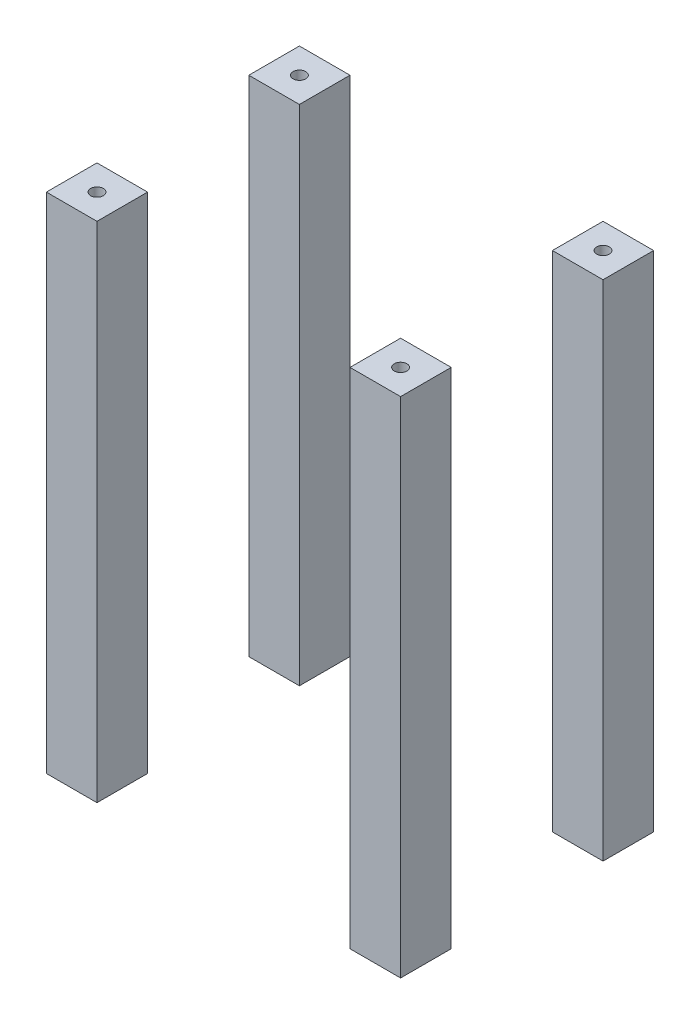
ISO-10303-21;
HEADER;
FILE_DESCRIPTION(('STEP AP214'),'2;1');
FILE_NAME('part.step','',(''),(''),'','','');
FILE_SCHEMA(('AUTOMOTIVE_DESIGN { 1 0 10303 214 1 1 1 1 }'));
ENDSEC;
DATA;
#1=APPLICATION_CONTEXT('core data for automotive mechanical design processes');
#2=APPLICATION_PROTOCOL_DEFINITION('international standard','automotive_design',2000,#1);
#3=PRODUCT_CONTEXT('',#1,'mechanical');
#4=PRODUCT('Part','Part','',(#3));
#5=PRODUCT_RELATED_PRODUCT_CATEGORY('part','',(#4));
#6=PRODUCT_DEFINITION_FORMATION('','',#4);
#7=PRODUCT_DEFINITION_CONTEXT('part definition',#1,'design');
#8=PRODUCT_DEFINITION('design','',#6,#7);
#9=PRODUCT_DEFINITION_SHAPE('','',#8);
#10=(LENGTH_UNIT() NAMED_UNIT(*) SI_UNIT(.MILLI.,.METRE.));
#11=(NAMED_UNIT(*) PLANE_ANGLE_UNIT() SI_UNIT($,.RADIAN.));
#12=(NAMED_UNIT(*) SI_UNIT($,.STERADIAN.) SOLID_ANGLE_UNIT());
#13=UNCERTAINTY_MEASURE_WITH_UNIT(LENGTH_MEASURE(1.E-05),#10,'distance_accuracy_value','');
#14=(GEOMETRIC_REPRESENTATION_CONTEXT(3) GLOBAL_UNCERTAINTY_ASSIGNED_CONTEXT((#13)) GLOBAL_UNIT_ASSIGNED_CONTEXT((#10,
#11,#12)) REPRESENTATION_CONTEXT('',''));
#15=CARTESIAN_POINT('',(0.,0.,0.));
#16=DIRECTION('',(0.,0.,1.));
#17=DIRECTION('',(1.,0.,0.));
#18=AXIS2_PLACEMENT_3D('',#15,#16,#17);
#19=CARTESIAN_POINT('',(0.,199.,0.));
#20=DIRECTION('',(0.,1.,0.));
#21=DIRECTION('',(0.,0.,1.));
#22=AXIS2_PLACEMENT_3D('',#19,#20,#21);
#23=PLANE('',#22);
#24=DIRECTION('',(0.,0.,1.));
#25=VECTOR('',#24,1.);
#26=CARTESIAN_POINT('',(-70.,199.,112.65));
#27=LINE('',#26,#25);
#28=CARTESIAN_POINT('',(-70.,199.,112.65));
#29=VERTEX_POINT('',#28);
#30=CARTESIAN_POINT('',(-70.,199.,132.65));
#31=VERTEX_POINT('',#30);
#32=EDGE_CURVE('E120',#29,#31,#27,.T.);
#33=ORIENTED_EDGE('',*,*,#32,.T.);
#34=DIRECTION('',(1.,0.,0.));
#35=VECTOR('',#34,1.);
#36=CARTESIAN_POINT('',(-70.,199.,132.65));
#37=LINE('',#36,#35);
#38=CARTESIAN_POINT('',(-50.,199.,132.65));
#39=VERTEX_POINT('',#38);
#40=EDGE_CURVE('E89',#31,#39,#37,.T.);
#41=ORIENTED_EDGE('',*,*,#40,.T.);
#42=DIRECTION('',(0.,0.,-1.));
#43=VECTOR('',#42,1.);
#44=CARTESIAN_POINT('',(-50.,199.,112.65));
#45=LINE('',#44,#43);
#46=CARTESIAN_POINT('',(-50.,199.,112.65));
#47=VERTEX_POINT('',#46);
#48=EDGE_CURVE('E128',#39,#47,#45,.T.);
#49=ORIENTED_EDGE('',*,*,#48,.T.);
#50=DIRECTION('',(-1.,0.,0.));
#51=VECTOR('',#50,1.);
#52=CARTESIAN_POINT('',(-70.,199.,112.65));
#53=LINE('',#52,#51);
#54=EDGE_CURVE('E113',#47,#29,#53,.T.);
#55=ORIENTED_EDGE('',*,*,#54,.T.);
#56=EDGE_LOOP('',(#33,#41,#49,#55));
#57=FACE_BOUND('',#56,.T.);
#58=CARTESIAN_POINT('',(-60.,199.,122.65));
#59=DIRECTION('',(0.,1.,0.));
#60=DIRECTION('',(0.,0.,1.));
#61=AXIS2_PLACEMENT_3D('',#58,#59,#60);
#62=CIRCLE('',#61,2.5);
#63=CARTESIAN_POINT('',(-60.,199.,125.15));
#64=VERTEX_POINT('',#63);
#65=EDGE_CURVE('E60',#64,#64,#62,.T.);
#66=ORIENTED_EDGE('',*,*,#65,.F.);
#67=EDGE_LOOP('',(#66));
#68=FACE_BOUND('',#67,.T.);
#69=ADVANCED_FACE('F56',(#57,#68),#23,.T.);
#70=CARTESIAN_POINT('',(0.,0.,0.));
#71=DIRECTION('',(0.,1.,0.));
#72=DIRECTION('',(0.,0.,1.));
#73=AXIS2_PLACEMENT_3D('',#70,#71,#72);
#74=PLANE('',#73);
#75=DIRECTION('',(0.,0.,1.));
#76=VECTOR('',#75,1.);
#77=CARTESIAN_POINT('',(-70.,0.,112.65));
#78=LINE('',#77,#76);
#79=CARTESIAN_POINT('',(-70.,0.,112.65));
#80=VERTEX_POINT('',#79);
#81=CARTESIAN_POINT('',(-70.,0.,132.65));
#82=VERTEX_POINT('',#81);
#83=EDGE_CURVE('E119',#80,#82,#78,.T.);
#84=ORIENTED_EDGE('',*,*,#83,.F.);
#85=DIRECTION('',(-1.,0.,0.));
#86=VECTOR('',#85,1.);
#87=CARTESIAN_POINT('',(-70.,0.,112.65));
#88=LINE('',#87,#86);
#89=CARTESIAN_POINT('',(-50.,0.,112.65));
#90=VERTEX_POINT('',#89);
#91=EDGE_CURVE('E99',#90,#80,#88,.T.);
#92=ORIENTED_EDGE('',*,*,#91,.F.);
#93=DIRECTION('',(0.,0.,-1.));
#94=VECTOR('',#93,1.);
#95=CARTESIAN_POINT('',(-50.,0.,112.65));
#96=LINE('',#95,#94);
#97=CARTESIAN_POINT('',(-50.,0.,132.65));
#98=VERTEX_POINT('',#97);
#99=EDGE_CURVE('E105',#98,#90,#96,.T.);
#100=ORIENTED_EDGE('',*,*,#99,.F.);
#101=DIRECTION('',(1.,0.,0.));
#102=VECTOR('',#101,1.);
#103=CARTESIAN_POINT('',(-70.,0.,132.65));
#104=LINE('',#103,#102);
#105=EDGE_CURVE('E73',#82,#98,#104,.T.);
#106=ORIENTED_EDGE('',*,*,#105,.F.);
#107=EDGE_LOOP('',(#84,#92,#100,#106));
#108=FACE_BOUND('',#107,.T.);
#109=CARTESIAN_POINT('',(-60.,0.,122.65));
#110=DIRECTION('',(0.,1.,0.));
#111=DIRECTION('',(0.,0.,1.));
#112=AXIS2_PLACEMENT_3D('',#109,#110,#111);
#113=CIRCLE('',#112,2.5);
#114=CARTESIAN_POINT('',(-60.,0.,125.15));
#115=VERTEX_POINT('',#114);
#116=EDGE_CURVE('E12',#115,#115,#113,.T.);
#117=ORIENTED_EDGE('',*,*,#116,.T.);
#118=EDGE_LOOP('',(#117));
#119=FACE_BOUND('',#118,.T.);
#120=ADVANCED_FACE('F116',(#108,#119),#74,.F.);
#121=CARTESIAN_POINT('',(-70.,199.,112.65));
#122=DIRECTION('',(1.,0.,0.));
#123=DIRECTION('',(0.,0.,-1.));
#124=AXIS2_PLACEMENT_3D('',#121,#122,#123);
#125=PLANE('',#124);
#126=ORIENTED_EDGE('',*,*,#83,.T.);
#127=DIRECTION('',(0.,-1.,0.));
#128=VECTOR('',#127,1.);
#129=CARTESIAN_POINT('',(-70.,199.,132.65));
#130=LINE('',#129,#128);
#131=EDGE_CURVE('E135',#31,#82,#130,.T.);
#132=ORIENTED_EDGE('',*,*,#131,.F.);
#133=ORIENTED_EDGE('',*,*,#32,.F.);
#134=DIRECTION('',(0.,-1.,0.));
#135=VECTOR('',#134,1.);
#136=CARTESIAN_POINT('',(-70.,199.,112.65));
#137=LINE('',#136,#135);
#138=EDGE_CURVE('E114',#29,#80,#137,.T.);
#139=ORIENTED_EDGE('',*,*,#138,.T.);
#140=EDGE_LOOP('',(#126,#132,#133,#139));
#141=FACE_BOUND('',#140,.T.);
#142=ADVANCED_FACE('F134',(#141),#125,.F.);
#143=CARTESIAN_POINT('',(-70.,199.,132.65));
#144=DIRECTION('',(0.,0.,-1.));
#145=DIRECTION('',(-1.,0.,0.));
#146=AXIS2_PLACEMENT_3D('',#143,#144,#145);
#147=PLANE('',#146);
#148=ORIENTED_EDGE('',*,*,#105,.T.);
#149=DIRECTION('',(0.,-1.,0.));
#150=VECTOR('',#149,1.);
#151=CARTESIAN_POINT('',(-50.,199.,132.65));
#152=LINE('',#151,#150);
#153=EDGE_CURVE('E110',#39,#98,#152,.T.);
#154=ORIENTED_EDGE('',*,*,#153,.F.);
#155=ORIENTED_EDGE('',*,*,#40,.F.);
#156=ORIENTED_EDGE('',*,*,#131,.T.);
#157=EDGE_LOOP('',(#148,#154,#155,#156));
#158=FACE_BOUND('',#157,.T.);
#159=ADVANCED_FACE('F138',(#158),#147,.F.);
#160=CARTESIAN_POINT('',(-50.,199.,112.65));
#161=DIRECTION('',(-1.,0.,0.));
#162=DIRECTION('',(0.,0.,1.));
#163=AXIS2_PLACEMENT_3D('',#160,#161,#162);
#164=PLANE('',#163);
#165=ORIENTED_EDGE('',*,*,#99,.T.);
#166=DIRECTION('',(0.,-1.,0.));
#167=VECTOR('',#166,1.);
#168=CARTESIAN_POINT('',(-50.,199.,112.65));
#169=LINE('',#168,#167);
#170=EDGE_CURVE('E108',#47,#90,#169,.T.);
#171=ORIENTED_EDGE('',*,*,#170,.F.);
#172=ORIENTED_EDGE('',*,*,#48,.F.);
#173=ORIENTED_EDGE('',*,*,#153,.T.);
#174=EDGE_LOOP('',(#165,#171,#172,#173));
#175=FACE_BOUND('',#174,.T.);
#176=ADVANCED_FACE('F106',(#175),#164,.F.);
#177=CARTESIAN_POINT('',(-70.,199.,112.65));
#178=DIRECTION('',(0.,0.,1.));
#179=DIRECTION('',(1.,0.,0.));
#180=AXIS2_PLACEMENT_3D('',#177,#178,#179);
#181=PLANE('',#180);
#182=ORIENTED_EDGE('',*,*,#91,.T.);
#183=ORIENTED_EDGE('',*,*,#138,.F.);
#184=ORIENTED_EDGE('',*,*,#54,.F.);
#185=ORIENTED_EDGE('',*,*,#170,.T.);
#186=EDGE_LOOP('',(#182,#183,#184,#185));
#187=FACE_BOUND('',#186,.T.);
#188=ADVANCED_FACE('F112',(#187),#181,.F.);
#189=CARTESIAN_POINT('',(-60.,199.,122.65));
#190=DIRECTION('',(0.,-1.,0.));
#191=DIRECTION('',(0.,0.,-1.));
#192=AXIS2_PLACEMENT_3D('',#189,#190,#191);
#193=CYLINDRICAL_SURFACE('',#192,2.5);
#194=ORIENTED_EDGE('',*,*,#65,.T.);
#195=EDGE_LOOP('',(#194));
#196=FACE_BOUND('',#195,.T.);
#197=ORIENTED_EDGE('',*,*,#116,.F.);
#198=EDGE_LOOP('',(#197));
#199=FACE_BOUND('',#198,.T.);
#200=ADVANCED_FACE('F58',(#196,#199),#193,.F.);
#201=CLOSED_SHELL('',(#69,#120,#142,#159,#176,#188,#200));
#202=MANIFOLD_SOLID_BREP('B2',#201);
#203=CARTESIAN_POINT('',(0.,199.,0.));
#204=DIRECTION('',(0.,1.,0.));
#205=DIRECTION('',(0.,0.,1.));
#206=AXIS2_PLACEMENT_3D('',#203,#204,#205);
#207=PLANE('',#206);
#208=DIRECTION('',(0.,0.,1.));
#209=VECTOR('',#208,1.);
#210=CARTESIAN_POINT('',(50.,199.,112.65));
#211=LINE('',#210,#209);
#212=CARTESIAN_POINT('',(50.,199.,112.65));
#213=VERTEX_POINT('',#212);
#214=CARTESIAN_POINT('',(50.,199.,132.65));
#215=VERTEX_POINT('',#214);
#216=EDGE_CURVE('E279',#213,#215,#211,.T.);
#217=ORIENTED_EDGE('',*,*,#216,.T.);
#218=DIRECTION('',(1.,0.,0.));
#219=VECTOR('',#218,1.);
#220=CARTESIAN_POINT('',(50.,199.,132.65));
#221=LINE('',#220,#219);
#222=CARTESIAN_POINT('',(70.,199.,132.65));
#223=VERTEX_POINT('',#222);
#224=EDGE_CURVE('E245',#215,#223,#221,.T.);
#225=ORIENTED_EDGE('',*,*,#224,.T.);
#226=DIRECTION('',(0.,0.,-1.));
#227=VECTOR('',#226,1.);
#228=CARTESIAN_POINT('',(70.,199.,112.65));
#229=LINE('',#228,#227);
#230=CARTESIAN_POINT('',(70.,199.,112.65));
#231=VERTEX_POINT('',#230);
#232=EDGE_CURVE('E291',#223,#231,#229,.T.);
#233=ORIENTED_EDGE('',*,*,#232,.T.);
#234=DIRECTION('',(-1.,0.,0.));
#235=VECTOR('',#234,1.);
#236=CARTESIAN_POINT('',(50.,199.,112.65));
#237=LINE('',#236,#235);
#238=EDGE_CURVE('E270',#231,#213,#237,.T.);
#239=ORIENTED_EDGE('',*,*,#238,.T.);
#240=EDGE_LOOP('',(#217,#225,#233,#239));
#241=FACE_BOUND('',#240,.T.);
#242=CARTESIAN_POINT('',(60.,199.,122.65));
#243=DIRECTION('',(0.,1.,0.));
#244=DIRECTION('',(0.,0.,1.));
#245=AXIS2_PLACEMENT_3D('',#242,#243,#244);
#246=CIRCLE('',#245,2.5);
#247=CARTESIAN_POINT('',(60.,199.,125.15));
#248=VERTEX_POINT('',#247);
#249=EDGE_CURVE('E215',#248,#248,#246,.T.);
#250=ORIENTED_EDGE('',*,*,#249,.F.);
#251=EDGE_LOOP('',(#250));
#252=FACE_BOUND('',#251,.T.);
#253=ADVANCED_FACE('F211',(#241,#252),#207,.T.);
#254=CARTESIAN_POINT('',(0.,0.,0.));
#255=DIRECTION('',(0.,1.,0.));
#256=DIRECTION('',(0.,0.,1.));
#257=AXIS2_PLACEMENT_3D('',#254,#255,#256);
#258=PLANE('',#257);
#259=DIRECTION('',(0.,0.,1.));
#260=VECTOR('',#259,1.);
#261=CARTESIAN_POINT('',(50.,0.,112.65));
#262=LINE('',#261,#260);
#263=CARTESIAN_POINT('',(50.,0.,112.65));
#264=VERTEX_POINT('',#263);
#265=CARTESIAN_POINT('',(50.,0.,132.65));
#266=VERTEX_POINT('',#265);
#267=EDGE_CURVE('E277',#264,#266,#262,.T.);
#268=ORIENTED_EDGE('',*,*,#267,.F.);
#269=DIRECTION('',(-1.,0.,0.));
#270=VECTOR('',#269,1.);
#271=CARTESIAN_POINT('',(50.,0.,112.65));
#272=LINE('',#271,#270);
#273=CARTESIAN_POINT('',(70.,0.,112.65));
#274=VERTEX_POINT('',#273);
#275=EDGE_CURVE('E255',#274,#264,#272,.T.);
#276=ORIENTED_EDGE('',*,*,#275,.F.);
#277=DIRECTION('',(0.,0.,-1.));
#278=VECTOR('',#277,1.);
#279=CARTESIAN_POINT('',(70.,0.,112.65));
#280=LINE('',#279,#278);
#281=CARTESIAN_POINT('',(70.,0.,132.65));
#282=VERTEX_POINT('',#281);
#283=EDGE_CURVE('E261',#282,#274,#280,.T.);
#284=ORIENTED_EDGE('',*,*,#283,.F.);
#285=DIRECTION('',(1.,0.,0.));
#286=VECTOR('',#285,1.);
#287=CARTESIAN_POINT('',(50.,0.,132.65));
#288=LINE('',#287,#286);
#289=EDGE_CURVE('E229',#266,#282,#288,.T.);
#290=ORIENTED_EDGE('',*,*,#289,.F.);
#291=EDGE_LOOP('',(#268,#276,#284,#290));
#292=FACE_BOUND('',#291,.T.);
#293=CARTESIAN_POINT('',(60.,0.,122.65));
#294=DIRECTION('',(0.,1.,0.));
#295=DIRECTION('',(0.,0.,1.));
#296=AXIS2_PLACEMENT_3D('',#293,#294,#295);
#297=CIRCLE('',#296,2.5);
#298=CARTESIAN_POINT('',(60.,0.,125.15));
#299=VERTEX_POINT('',#298);
#300=EDGE_CURVE('E54',#299,#299,#297,.T.);
#301=ORIENTED_EDGE('',*,*,#300,.T.);
#302=EDGE_LOOP('',(#301));
#303=FACE_BOUND('',#302,.T.);
#304=ADVANCED_FACE('F274',(#292,#303),#258,.F.);
#305=CARTESIAN_POINT('',(50.,199.,112.65));
#306=DIRECTION('',(1.,0.,0.));
#307=DIRECTION('',(0.,0.,-1.));
#308=AXIS2_PLACEMENT_3D('',#305,#306,#307);
#309=PLANE('',#308);
#310=ORIENTED_EDGE('',*,*,#267,.T.);
#311=DIRECTION('',(0.,-1.,0.));
#312=VECTOR('',#311,1.);
#313=CARTESIAN_POINT('',(50.,199.,132.65));
#314=LINE('',#313,#312);
#315=EDGE_CURVE('E298',#215,#266,#314,.T.);
#316=ORIENTED_EDGE('',*,*,#315,.F.);
#317=ORIENTED_EDGE('',*,*,#216,.F.);
#318=DIRECTION('',(0.,-1.,0.));
#319=VECTOR('',#318,1.);
#320=CARTESIAN_POINT('',(50.,199.,112.65));
#321=LINE('',#320,#319);
#322=EDGE_CURVE('E272',#213,#264,#321,.T.);
#323=ORIENTED_EDGE('',*,*,#322,.T.);
#324=EDGE_LOOP('',(#310,#316,#317,#323));
#325=FACE_BOUND('',#324,.T.);
#326=ADVANCED_FACE('F305',(#325),#309,.F.);
#327=CARTESIAN_POINT('',(50.,199.,132.65));
#328=DIRECTION('',(0.,0.,-1.));
#329=DIRECTION('',(-1.,0.,0.));
#330=AXIS2_PLACEMENT_3D('',#327,#328,#329);
#331=PLANE('',#330);
#332=ORIENTED_EDGE('',*,*,#289,.T.);
#333=DIRECTION('',(0.,-1.,0.));
#334=VECTOR('',#333,1.);
#335=CARTESIAN_POINT('',(70.,199.,132.65));
#336=LINE('',#335,#334);
#337=EDGE_CURVE('E266',#223,#282,#336,.T.);
#338=ORIENTED_EDGE('',*,*,#337,.F.);
#339=ORIENTED_EDGE('',*,*,#224,.F.);
#340=ORIENTED_EDGE('',*,*,#315,.T.);
#341=EDGE_LOOP('',(#332,#338,#339,#340));
#342=FACE_BOUND('',#341,.T.);
#343=ADVANCED_FACE('F302',(#342),#331,.F.);
#344=CARTESIAN_POINT('',(70.,199.,112.65));
#345=DIRECTION('',(-1.,0.,0.));
#346=DIRECTION('',(0.,0.,1.));
#347=AXIS2_PLACEMENT_3D('',#344,#345,#346);
#348=PLANE('',#347);
#349=ORIENTED_EDGE('',*,*,#283,.T.);
#350=DIRECTION('',(0.,-1.,0.));
#351=VECTOR('',#350,1.);
#352=CARTESIAN_POINT('',(70.,199.,112.65));
#353=LINE('',#352,#351);
#354=EDGE_CURVE('E264',#231,#274,#353,.T.);
#355=ORIENTED_EDGE('',*,*,#354,.F.);
#356=ORIENTED_EDGE('',*,*,#232,.F.);
#357=ORIENTED_EDGE('',*,*,#337,.T.);
#358=EDGE_LOOP('',(#349,#355,#356,#357));
#359=FACE_BOUND('',#358,.T.);
#360=ADVANCED_FACE('F262',(#359),#348,.F.);
#361=CARTESIAN_POINT('',(50.,199.,112.65));
#362=DIRECTION('',(0.,0.,1.));
#363=DIRECTION('',(1.,0.,0.));
#364=AXIS2_PLACEMENT_3D('',#361,#362,#363);
#365=PLANE('',#364);
#366=ORIENTED_EDGE('',*,*,#275,.T.);
#367=ORIENTED_EDGE('',*,*,#322,.F.);
#368=ORIENTED_EDGE('',*,*,#238,.F.);
#369=ORIENTED_EDGE('',*,*,#354,.T.);
#370=EDGE_LOOP('',(#366,#367,#368,#369));
#371=FACE_BOUND('',#370,.T.);
#372=ADVANCED_FACE('F269',(#371),#365,.F.);
#373=CARTESIAN_POINT('',(60.,199.,122.65));
#374=DIRECTION('',(0.,-1.,0.));
#375=DIRECTION('',(0.,0.,-1.));
#376=AXIS2_PLACEMENT_3D('',#373,#374,#375);
#377=CYLINDRICAL_SURFACE('',#376,2.5);
#378=ORIENTED_EDGE('',*,*,#249,.T.);
#379=EDGE_LOOP('',(#378));
#380=FACE_BOUND('',#379,.T.);
#381=ORIENTED_EDGE('',*,*,#300,.F.);
#382=EDGE_LOOP('',(#381));
#383=FACE_BOUND('',#382,.T.);
#384=ADVANCED_FACE('F213',(#380,#383),#377,.F.);
#385=CLOSED_SHELL('',(#253,#304,#326,#343,#360,#372,#384));
#386=MANIFOLD_SOLID_BREP('B6',#385);
#387=CARTESIAN_POINT('',(0.,199.,0.));
#388=DIRECTION('',(0.,1.,0.));
#389=DIRECTION('',(0.,0.,1.));
#390=AXIS2_PLACEMENT_3D('',#387,#388,#389);
#391=PLANE('',#390);
#392=DIRECTION('',(0.,0.,1.));
#393=VECTOR('',#392,1.);
#394=CARTESIAN_POINT('',(50.,199.,32.65));
#395=LINE('',#394,#393);
#396=CARTESIAN_POINT('',(50.,199.,32.65));
#397=VERTEX_POINT('',#396);
#398=CARTESIAN_POINT('',(50.,199.,52.65));
#399=VERTEX_POINT('',#398);
#400=EDGE_CURVE('E443',#397,#399,#395,.T.);
#401=ORIENTED_EDGE('',*,*,#400,.T.);
#402=DIRECTION('',(1.,0.,0.));
#403=VECTOR('',#402,1.);
#404=CARTESIAN_POINT('',(50.,199.,52.65));
#405=LINE('',#404,#403);
#406=CARTESIAN_POINT('',(70.,199.,52.65));
#407=VERTEX_POINT('',#406);
#408=EDGE_CURVE('E412',#399,#407,#405,.T.);
#409=ORIENTED_EDGE('',*,*,#408,.T.);
#410=DIRECTION('',(0.,0.,-1.));
#411=VECTOR('',#410,1.);
#412=CARTESIAN_POINT('',(70.,199.,32.65));
#413=LINE('',#412,#411);
#414=CARTESIAN_POINT('',(70.,199.,32.65));
#415=VERTEX_POINT('',#414);
#416=EDGE_CURVE('E451',#407,#415,#413,.T.);
#417=ORIENTED_EDGE('',*,*,#416,.T.);
#418=DIRECTION('',(-1.,0.,0.));
#419=VECTOR('',#418,1.);
#420=CARTESIAN_POINT('',(50.,199.,32.65));
#421=LINE('',#420,#419);
#422=EDGE_CURVE('E436',#415,#397,#421,.T.);
#423=ORIENTED_EDGE('',*,*,#422,.T.);
#424=EDGE_LOOP('',(#401,#409,#417,#423));
#425=FACE_BOUND('',#424,.T.);
#426=CARTESIAN_POINT('',(60.,199.,42.65));
#427=DIRECTION('',(0.,1.,0.));
#428=DIRECTION('',(0.,0.,1.));
#429=AXIS2_PLACEMENT_3D('',#426,#427,#428);
#430=CIRCLE('',#429,2.5);
#431=CARTESIAN_POINT('',(60.,199.,45.15));
#432=VERTEX_POINT('',#431);
#433=EDGE_CURVE('E383',#432,#432,#430,.T.);
#434=ORIENTED_EDGE('',*,*,#433,.F.);
#435=EDGE_LOOP('',(#434));
#436=FACE_BOUND('',#435,.T.);
#437=ADVANCED_FACE('F379',(#425,#436),#391,.T.);
#438=CARTESIAN_POINT('',(0.,0.,0.));
#439=DIRECTION('',(0.,1.,0.));
#440=DIRECTION('',(0.,0.,1.));
#441=AXIS2_PLACEMENT_3D('',#438,#439,#440);
#442=PLANE('',#441);
#443=DIRECTION('',(0.,0.,1.));
#444=VECTOR('',#443,1.);
#445=CARTESIAN_POINT('',(50.,0.,32.65));
#446=LINE('',#445,#444);
#447=CARTESIAN_POINT('',(50.,0.,32.65));
#448=VERTEX_POINT('',#447);
#449=CARTESIAN_POINT('',(50.,0.,52.65));
#450=VERTEX_POINT('',#449);
#451=EDGE_CURVE('E442',#448,#450,#446,.T.);
#452=ORIENTED_EDGE('',*,*,#451,.F.);
#453=DIRECTION('',(-1.,0.,0.));
#454=VECTOR('',#453,1.);
#455=CARTESIAN_POINT('',(50.,0.,32.65));
#456=LINE('',#455,#454);
#457=CARTESIAN_POINT('',(70.,0.,32.65));
#458=VERTEX_POINT('',#457);
#459=EDGE_CURVE('E422',#458,#448,#456,.T.);
#460=ORIENTED_EDGE('',*,*,#459,.F.);
#461=DIRECTION('',(0.,0.,-1.));
#462=VECTOR('',#461,1.);
#463=CARTESIAN_POINT('',(70.,0.,32.65));
#464=LINE('',#463,#462);
#465=CARTESIAN_POINT('',(70.,0.,52.65));
#466=VERTEX_POINT('',#465);
#467=EDGE_CURVE('E428',#466,#458,#464,.T.);
#468=ORIENTED_EDGE('',*,*,#467,.F.);
#469=DIRECTION('',(1.,0.,0.));
#470=VECTOR('',#469,1.);
#471=CARTESIAN_POINT('',(50.,0.,52.65));
#472=LINE('',#471,#470);
#473=EDGE_CURVE('E396',#450,#466,#472,.T.);
#474=ORIENTED_EDGE('',*,*,#473,.F.);
#475=EDGE_LOOP('',(#452,#460,#468,#474));
#476=FACE_BOUND('',#475,.T.);
#477=CARTESIAN_POINT('',(60.,0.,42.65));
#478=DIRECTION('',(0.,1.,0.));
#479=DIRECTION('',(0.,0.,1.));
#480=AXIS2_PLACEMENT_3D('',#477,#478,#479);
#481=CIRCLE('',#480,2.5);
#482=CARTESIAN_POINT('',(60.,0.,45.15));
#483=VERTEX_POINT('',#482);
#484=EDGE_CURVE('E209',#483,#483,#481,.T.);
#485=ORIENTED_EDGE('',*,*,#484,.T.);
#486=EDGE_LOOP('',(#485));
#487=FACE_BOUND('',#486,.T.);
#488=ADVANCED_FACE('F439',(#476,#487),#442,.F.);
#489=CARTESIAN_POINT('',(50.,199.,32.65));
#490=DIRECTION('',(1.,0.,0.));
#491=DIRECTION('',(0.,0.,-1.));
#492=AXIS2_PLACEMENT_3D('',#489,#490,#491);
#493=PLANE('',#492);
#494=ORIENTED_EDGE('',*,*,#451,.T.);
#495=DIRECTION('',(0.,-1.,0.));
#496=VECTOR('',#495,1.);
#497=CARTESIAN_POINT('',(50.,199.,52.65));
#498=LINE('',#497,#496);
#499=EDGE_CURVE('E458',#399,#450,#498,.T.);
#500=ORIENTED_EDGE('',*,*,#499,.F.);
#501=ORIENTED_EDGE('',*,*,#400,.F.);
#502=DIRECTION('',(0.,-1.,0.));
#503=VECTOR('',#502,1.);
#504=CARTESIAN_POINT('',(50.,199.,32.65));
#505=LINE('',#504,#503);
#506=EDGE_CURVE('E437',#397,#448,#505,.T.);
#507=ORIENTED_EDGE('',*,*,#506,.T.);
#508=EDGE_LOOP('',(#494,#500,#501,#507));
#509=FACE_BOUND('',#508,.T.);
#510=ADVANCED_FACE('F457',(#509),#493,.F.);
#511=CARTESIAN_POINT('',(50.,199.,52.65));
#512=DIRECTION('',(0.,0.,-1.));
#513=DIRECTION('',(-1.,0.,0.));
#514=AXIS2_PLACEMENT_3D('',#511,#512,#513);
#515=PLANE('',#514);
#516=ORIENTED_EDGE('',*,*,#473,.T.);
#517=DIRECTION('',(0.,-1.,0.));
#518=VECTOR('',#517,1.);
#519=CARTESIAN_POINT('',(70.,199.,52.65));
#520=LINE('',#519,#518);
#521=EDGE_CURVE('E433',#407,#466,#520,.T.);
#522=ORIENTED_EDGE('',*,*,#521,.F.);
#523=ORIENTED_EDGE('',*,*,#408,.F.);
#524=ORIENTED_EDGE('',*,*,#499,.T.);
#525=EDGE_LOOP('',(#516,#522,#523,#524));
#526=FACE_BOUND('',#525,.T.);
#527=ADVANCED_FACE('F461',(#526),#515,.F.);
#528=CARTESIAN_POINT('',(70.,199.,32.65));
#529=DIRECTION('',(-1.,0.,0.));
#530=DIRECTION('',(0.,0.,1.));
#531=AXIS2_PLACEMENT_3D('',#528,#529,#530);
#532=PLANE('',#531);
#533=ORIENTED_EDGE('',*,*,#467,.T.);
#534=DIRECTION('',(0.,-1.,0.));
#535=VECTOR('',#534,1.);
#536=CARTESIAN_POINT('',(70.,199.,32.65));
#537=LINE('',#536,#535);
#538=EDGE_CURVE('E431',#415,#458,#537,.T.);
#539=ORIENTED_EDGE('',*,*,#538,.F.);
#540=ORIENTED_EDGE('',*,*,#416,.F.);
#541=ORIENTED_EDGE('',*,*,#521,.T.);
#542=EDGE_LOOP('',(#533,#539,#540,#541));
#543=FACE_BOUND('',#542,.T.);
#544=ADVANCED_FACE('F429',(#543),#532,.F.);
#545=CARTESIAN_POINT('',(50.,199.,32.65));
#546=DIRECTION('',(0.,0.,1.));
#547=DIRECTION('',(1.,0.,0.));
#548=AXIS2_PLACEMENT_3D('',#545,#546,#547);
#549=PLANE('',#548);
#550=ORIENTED_EDGE('',*,*,#459,.T.);
#551=ORIENTED_EDGE('',*,*,#506,.F.);
#552=ORIENTED_EDGE('',*,*,#422,.F.);
#553=ORIENTED_EDGE('',*,*,#538,.T.);
#554=EDGE_LOOP('',(#550,#551,#552,#553));
#555=FACE_BOUND('',#554,.T.);
#556=ADVANCED_FACE('F435',(#555),#549,.F.);
#557=CARTESIAN_POINT('',(60.,199.,42.65));
#558=DIRECTION('',(0.,-1.,0.));
#559=DIRECTION('',(0.,0.,-1.));
#560=AXIS2_PLACEMENT_3D('',#557,#558,#559);
#561=CYLINDRICAL_SURFACE('',#560,2.5);
#562=ORIENTED_EDGE('',*,*,#433,.T.);
#563=EDGE_LOOP('',(#562));
#564=FACE_BOUND('',#563,.T.);
#565=ORIENTED_EDGE('',*,*,#484,.F.);
#566=EDGE_LOOP('',(#565));
#567=FACE_BOUND('',#566,.T.);
#568=ADVANCED_FACE('F381',(#564,#567),#561,.F.);
#569=CLOSED_SHELL('',(#437,#488,#510,#527,#544,#556,#568));
#570=MANIFOLD_SOLID_BREP('B48',#569);
#571=CARTESIAN_POINT('',(0.,199.,0.));
#572=DIRECTION('',(0.,1.,0.));
#573=DIRECTION('',(0.,0.,1.));
#574=AXIS2_PLACEMENT_3D('',#571,#572,#573);
#575=PLANE('',#574);
#576=DIRECTION('',(0.,0.,1.));
#577=VECTOR('',#576,1.);
#578=CARTESIAN_POINT('',(-70.,199.,32.65));
#579=LINE('',#578,#577);
#580=CARTESIAN_POINT('',(-70.,199.,32.65));
#581=VERTEX_POINT('',#580);
#582=CARTESIAN_POINT('',(-70.,199.,52.65));
#583=VERTEX_POINT('',#582);
#584=EDGE_CURVE('E576',#581,#583,#579,.T.);
#585=ORIENTED_EDGE('',*,*,#584,.T.);
#586=DIRECTION('',(1.,0.,0.));
#587=VECTOR('',#586,1.);
#588=CARTESIAN_POINT('',(-70.,199.,52.65));
#589=LINE('',#588,#587);
#590=CARTESIAN_POINT('',(-50.,199.,52.65));
#591=VERTEX_POINT('',#590);
#592=EDGE_CURVE('E571',#583,#591,#589,.T.);
#593=ORIENTED_EDGE('',*,*,#592,.T.);
#594=DIRECTION('',(0.,0.,-1.));
#595=VECTOR('',#594,1.);
#596=CARTESIAN_POINT('',(-50.,199.,32.65));
#597=LINE('',#596,#595);
#598=CARTESIAN_POINT('',(-50.,199.,32.65));
#599=VERTEX_POINT('',#598);
#600=EDGE_CURVE('E574',#591,#599,#597,.T.);
#601=ORIENTED_EDGE('',*,*,#600,.T.);
#602=DIRECTION('',(-1.,0.,0.));
#603=VECTOR('',#602,1.);
#604=CARTESIAN_POINT('',(-70.,199.,32.65));
#605=LINE('',#604,#603);
#606=EDGE_CURVE('E541',#599,#581,#605,.T.);
#607=ORIENTED_EDGE('',*,*,#606,.T.);
#608=EDGE_LOOP('',(#585,#593,#601,#607));
#609=FACE_BOUND('',#608,.T.);
#610=CARTESIAN_POINT('',(-60.,199.,42.65));
#611=DIRECTION('',(0.,1.,0.));
#612=DIRECTION('',(0.,0.,1.));
#613=AXIS2_PLACEMENT_3D('',#610,#611,#612);
#614=CIRCLE('',#613,2.5);
#615=CARTESIAN_POINT('',(-60.,199.,45.15));
#616=VERTEX_POINT('',#615);
#617=EDGE_CURVE('E591',#616,#616,#614,.T.);
#618=ORIENTED_EDGE('',*,*,#617,.F.);
#619=EDGE_LOOP('',(#618));
#620=FACE_BOUND('',#619,.T.);
#621=ADVANCED_FACE('F524',(#609,#620),#575,.T.);
#622=CARTESIAN_POINT('',(0.,0.,0.));
#623=DIRECTION('',(0.,1.,0.));
#624=DIRECTION('',(0.,0.,1.));
#625=AXIS2_PLACEMENT_3D('',#622,#623,#624);
#626=PLANE('',#625);
#627=DIRECTION('',(0.,0.,1.));
#628=VECTOR('',#627,1.);
#629=CARTESIAN_POINT('',(-70.,0.,32.65));
#630=LINE('',#629,#628);
#631=CARTESIAN_POINT('',(-70.,0.,32.65));
#632=VERTEX_POINT('',#631);
#633=CARTESIAN_POINT('',(-70.,0.,52.65));
#634=VERTEX_POINT('',#633);
#635=EDGE_CURVE('E588',#632,#634,#630,.T.);
#636=ORIENTED_EDGE('',*,*,#635,.F.);
#637=DIRECTION('',(-1.,0.,0.));
#638=VECTOR('',#637,1.);
#639=CARTESIAN_POINT('',(-70.,0.,32.65));
#640=LINE('',#639,#638);
#641=CARTESIAN_POINT('',(-50.,0.,32.65));
#642=VERTEX_POINT('',#641);
#643=EDGE_CURVE('E564',#642,#632,#640,.T.);
#644=ORIENTED_EDGE('',*,*,#643,.F.);
#645=DIRECTION('',(0.,0.,-1.));
#646=VECTOR('',#645,1.);
#647=CARTESIAN_POINT('',(-50.,0.,32.65));
#648=LINE('',#647,#646);
#649=CARTESIAN_POINT('',(-50.,0.,52.65));
#650=VERTEX_POINT('',#649);
#651=EDGE_CURVE('E558',#650,#642,#648,.T.);
#652=ORIENTED_EDGE('',*,*,#651,.F.);
#653=DIRECTION('',(1.,0.,0.));
#654=VECTOR('',#653,1.);
#655=CARTESIAN_POINT('',(-70.,0.,52.65));
#656=LINE('',#655,#654);
#657=EDGE_CURVE('E580',#634,#650,#656,.T.);
#658=ORIENTED_EDGE('',*,*,#657,.F.);
#659=EDGE_LOOP('',(#636,#644,#652,#658));
#660=FACE_BOUND('',#659,.T.);
#661=CARTESIAN_POINT('',(-60.,0.,42.65));
#662=DIRECTION('',(0.,1.,0.));
#663=DIRECTION('',(0.,0.,1.));
#664=AXIS2_PLACEMENT_3D('',#661,#662,#663);
#665=CIRCLE('',#664,2.5);
#666=CARTESIAN_POINT('',(-60.,0.,45.15));
#667=VERTEX_POINT('',#666);
#668=EDGE_CURVE('E603',#667,#667,#665,.T.);
#669=ORIENTED_EDGE('',*,*,#668,.T.);
#670=EDGE_LOOP('',(#669));
#671=FACE_BOUND('',#670,.T.);
#672=ADVANCED_FACE('F599',(#660,#671),#626,.F.);
#673=CARTESIAN_POINT('',(-70.,199.,32.65));
#674=DIRECTION('',(1.,0.,0.));
#675=DIRECTION('',(0.,0.,-1.));
#676=AXIS2_PLACEMENT_3D('',#673,#674,#675);
#677=PLANE('',#676);
#678=ORIENTED_EDGE('',*,*,#635,.T.);
#679=DIRECTION('',(0.,-1.,0.));
#680=VECTOR('',#679,1.);
#681=CARTESIAN_POINT('',(-70.,199.,52.65));
#682=LINE('',#681,#680);
#683=EDGE_CURVE('E377',#583,#634,#682,.T.);
#684=ORIENTED_EDGE('',*,*,#683,.F.);
#685=ORIENTED_EDGE('',*,*,#584,.F.);
#686=DIRECTION('',(0.,-1.,0.));
#687=VECTOR('',#686,1.);
#688=CARTESIAN_POINT('',(-70.,199.,32.65));
#689=LINE('',#688,#687);
#690=EDGE_CURVE('E584',#581,#632,#689,.T.);
#691=ORIENTED_EDGE('',*,*,#690,.T.);
#692=EDGE_LOOP('',(#678,#684,#685,#691));
#693=FACE_BOUND('',#692,.T.);
#694=ADVANCED_FACE('F526',(#693),#677,.F.);
#695=CARTESIAN_POINT('',(-70.,199.,52.65));
#696=DIRECTION('',(0.,0.,-1.));
#697=DIRECTION('',(-1.,0.,0.));
#698=AXIS2_PLACEMENT_3D('',#695,#696,#697);
#699=PLANE('',#698);
#700=ORIENTED_EDGE('',*,*,#657,.T.);
#701=DIRECTION('',(0.,-1.,0.));
#702=VECTOR('',#701,1.);
#703=CARTESIAN_POINT('',(-50.,199.,52.65));
#704=LINE('',#703,#702);
#705=EDGE_CURVE('E533',#591,#650,#704,.T.);
#706=ORIENTED_EDGE('',*,*,#705,.F.);
#707=ORIENTED_EDGE('',*,*,#592,.F.);
#708=ORIENTED_EDGE('',*,*,#683,.T.);
#709=EDGE_LOOP('',(#700,#706,#707,#708));
#710=FACE_BOUND('',#709,.T.);
#711=ADVANCED_FACE('F579',(#710),#699,.F.);
#712=CARTESIAN_POINT('',(-50.,199.,32.65));
#713=DIRECTION('',(-1.,0.,0.));
#714=DIRECTION('',(0.,0.,1.));
#715=AXIS2_PLACEMENT_3D('',#712,#713,#714);
#716=PLANE('',#715);
#717=ORIENTED_EDGE('',*,*,#651,.T.);
#718=DIRECTION('',(0.,-1.,0.));
#719=VECTOR('',#718,1.);
#720=CARTESIAN_POINT('',(-50.,199.,32.65));
#721=LINE('',#720,#719);
#722=EDGE_CURVE('E581',#599,#642,#721,.T.);
#723=ORIENTED_EDGE('',*,*,#722,.F.);
#724=ORIENTED_EDGE('',*,*,#600,.F.);
#725=ORIENTED_EDGE('',*,*,#705,.T.);
#726=EDGE_LOOP('',(#717,#723,#724,#725));
#727=FACE_BOUND('',#726,.T.);
#728=ADVANCED_FACE('F582',(#727),#716,.F.);
#729=CARTESIAN_POINT('',(-70.,199.,32.65));
#730=DIRECTION('',(0.,0.,1.));
#731=DIRECTION('',(1.,0.,0.));
#732=AXIS2_PLACEMENT_3D('',#729,#730,#731);
#733=PLANE('',#732);
#734=ORIENTED_EDGE('',*,*,#643,.T.);
#735=ORIENTED_EDGE('',*,*,#690,.F.);
#736=ORIENTED_EDGE('',*,*,#606,.F.);
#737=ORIENTED_EDGE('',*,*,#722,.T.);
#738=EDGE_LOOP('',(#734,#735,#736,#737));
#739=FACE_BOUND('',#738,.T.);
#740=ADVANCED_FACE('F596',(#739),#733,.F.);
#741=CARTESIAN_POINT('',(-60.,199.,42.65));
#742=DIRECTION('',(0.,-1.,0.));
#743=DIRECTION('',(0.,0.,-1.));
#744=AXIS2_PLACEMENT_3D('',#741,#742,#743);
#745=CYLINDRICAL_SURFACE('',#744,2.5);
#746=ORIENTED_EDGE('',*,*,#617,.T.);
#747=EDGE_LOOP('',(#746));
#748=FACE_BOUND('',#747,.T.);
#749=ORIENTED_EDGE('',*,*,#668,.F.);
#750=EDGE_LOOP('',(#749));
#751=FACE_BOUND('',#750,.T.);
#752=ADVANCED_FACE('F609',(#748,#751),#745,.F.);
#753=CLOSED_SHELL('',(#621,#672,#694,#711,#728,#740,#752));
#754=MANIFOLD_SOLID_BREP('B203',#753);
#755=ADVANCED_BREP_SHAPE_REPRESENTATION('',(#18,#202,#386,#570,#754),#14);
#756=SHAPE_DEFINITION_REPRESENTATION(#9,#755);
ENDSEC;
END-ISO-10303-21;
